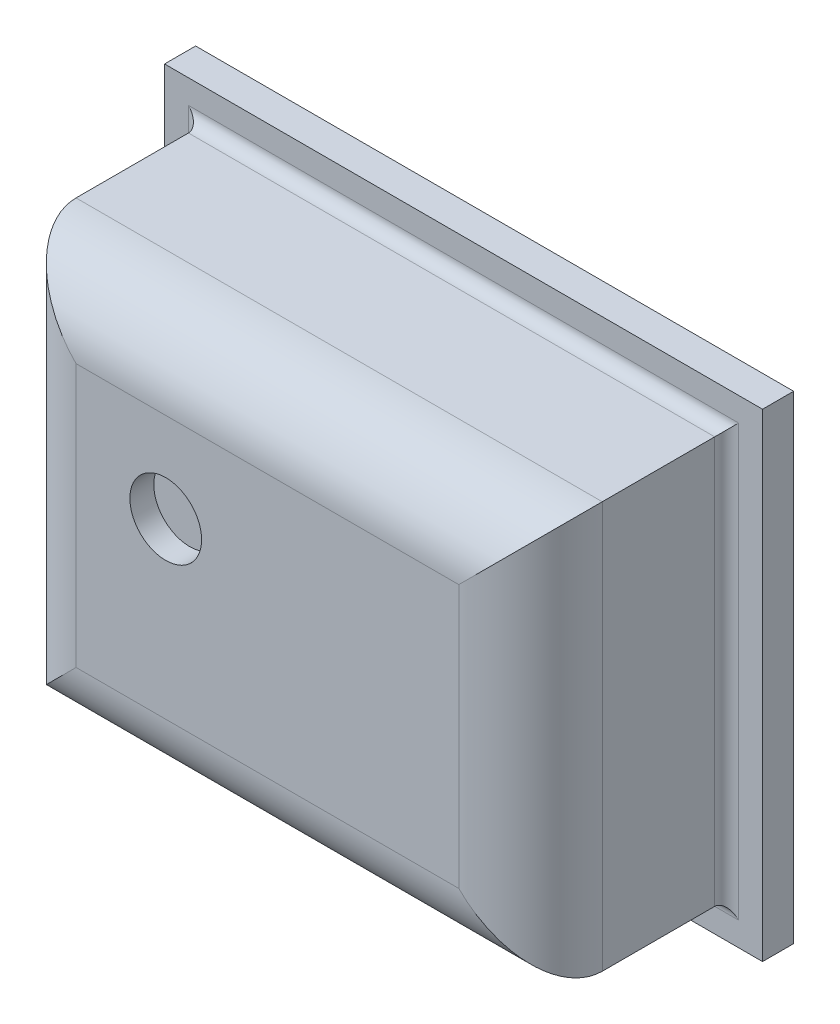
ISO-10303-21;
HEADER;
FILE_DESCRIPTION(('STEP AP214'),'2;1');
FILE_NAME('part.step','',(''),(''),'','','');
FILE_SCHEMA(('AUTOMOTIVE_DESIGN { 1 0 10303 214 1 1 1 1 }'));
ENDSEC;
DATA;
#1=APPLICATION_CONTEXT('core data for automotive mechanical design processes');
#2=APPLICATION_PROTOCOL_DEFINITION('international standard','automotive_design',2000,#1);
#3=PRODUCT_CONTEXT('',#1,'mechanical');
#4=PRODUCT('Part','Part','',(#3));
#5=PRODUCT_RELATED_PRODUCT_CATEGORY('part','',(#4));
#6=PRODUCT_DEFINITION_FORMATION('','',#4);
#7=PRODUCT_DEFINITION_CONTEXT('part definition',#1,'design');
#8=PRODUCT_DEFINITION('design','',#6,#7);
#9=PRODUCT_DEFINITION_SHAPE('','',#8);
#10=(LENGTH_UNIT() NAMED_UNIT(*) SI_UNIT(.MILLI.,.METRE.));
#11=(NAMED_UNIT(*) PLANE_ANGLE_UNIT() SI_UNIT($,.RADIAN.));
#12=(NAMED_UNIT(*) SI_UNIT($,.STERADIAN.) SOLID_ANGLE_UNIT());
#13=UNCERTAINTY_MEASURE_WITH_UNIT(LENGTH_MEASURE(1.E-05),#10,'distance_accuracy_value','');
#14=(GEOMETRIC_REPRESENTATION_CONTEXT(3) GLOBAL_UNCERTAINTY_ASSIGNED_CONTEXT((#13)) GLOBAL_UNIT_ASSIGNED_CONTEXT((#10,
#11,#12)) REPRESENTATION_CONTEXT('',''));
#15=CARTESIAN_POINT('',(0.,0.,0.));
#16=DIRECTION('',(0.,0.,1.));
#17=DIRECTION('',(1.,0.,0.));
#18=AXIS2_PLACEMENT_3D('',#15,#16,#17);
#19=CARTESIAN_POINT('',(1.25,1.,0.13));
#20=DIRECTION('',(-1.,0.,0.));
#21=DIRECTION('',(0.,-1.,0.));
#22=AXIS2_PLACEMENT_3D('',#19,#20,#21);
#23=PLANE('',#22);
#24=DIRECTION('',(0.,1.,0.));
#25=VECTOR('',#24,1.);
#26=CARTESIAN_POINT('',(1.25,1.,0.));
#27=LINE('',#26,#25);
#28=CARTESIAN_POINT('',(1.25,-1.,0.));
#29=VERTEX_POINT('',#28);
#30=CARTESIAN_POINT('',(1.25,1.,0.));
#31=VERTEX_POINT('',#30);
#32=EDGE_CURVE('E146',#29,#31,#27,.T.);
#33=ORIENTED_EDGE('',*,*,#32,.T.);
#34=DIRECTION('',(0.,0.,-1.));
#35=VECTOR('',#34,1.);
#36=CARTESIAN_POINT('',(1.25,1.,0.13));
#37=LINE('',#36,#35);
#38=CARTESIAN_POINT('',(1.25,1.,0.13));
#39=VERTEX_POINT('',#38);
#40=EDGE_CURVE('E127',#39,#31,#37,.T.);
#41=ORIENTED_EDGE('',*,*,#40,.F.);
#42=DIRECTION('',(0.,1.,0.));
#43=VECTOR('',#42,1.);
#44=CARTESIAN_POINT('',(1.25,1.,0.13));
#45=LINE('',#44,#43);
#46=CARTESIAN_POINT('',(1.25,-1.,0.13));
#47=VERTEX_POINT('',#46);
#48=EDGE_CURVE('E134',#47,#39,#45,.T.);
#49=ORIENTED_EDGE('',*,*,#48,.F.);
#50=DIRECTION('',(0.,0.,-1.));
#51=VECTOR('',#50,1.);
#52=CARTESIAN_POINT('',(1.25,-1.,0.13));
#53=LINE('',#52,#51);
#54=EDGE_CURVE('E228',#47,#29,#53,.T.);
#55=ORIENTED_EDGE('',*,*,#54,.T.);
#56=EDGE_LOOP('',(#33,#41,#49,#55));
#57=FACE_BOUND('',#56,.T.);
#58=ADVANCED_FACE('F32',(#57),#23,.F.);
#59=CARTESIAN_POINT('',(-1.25,1.,0.13));
#60=DIRECTION('',(0.,-1.,0.));
#61=DIRECTION('',(0.,0.,-1.));
#62=AXIS2_PLACEMENT_3D('',#59,#60,#61);
#63=PLANE('',#62);
#64=DIRECTION('',(-1.,0.,0.));
#65=VECTOR('',#64,1.);
#66=CARTESIAN_POINT('',(-1.25,1.,0.));
#67=LINE('',#66,#65);
#68=CARTESIAN_POINT('',(-1.25,1.,0.));
#69=VERTEX_POINT('',#68);
#70=EDGE_CURVE('E230',#31,#69,#67,.T.);
#71=ORIENTED_EDGE('',*,*,#70,.T.);
#72=DIRECTION('',(0.,0.,-1.));
#73=VECTOR('',#72,1.);
#74=CARTESIAN_POINT('',(-1.25,1.,0.13));
#75=LINE('',#74,#73);
#76=CARTESIAN_POINT('',(-1.25,1.,0.13));
#77=VERTEX_POINT('',#76);
#78=EDGE_CURVE('E130',#77,#69,#75,.T.);
#79=ORIENTED_EDGE('',*,*,#78,.F.);
#80=DIRECTION('',(-1.,0.,0.));
#81=VECTOR('',#80,1.);
#82=CARTESIAN_POINT('',(-1.25,1.,0.13));
#83=LINE('',#82,#81);
#84=EDGE_CURVE('E123',#39,#77,#83,.T.);
#85=ORIENTED_EDGE('',*,*,#84,.F.);
#86=ORIENTED_EDGE('',*,*,#40,.T.);
#87=EDGE_LOOP('',(#71,#79,#85,#86));
#88=FACE_BOUND('',#87,.T.);
#89=ADVANCED_FACE('F125',(#88),#63,.F.);
#90=CARTESIAN_POINT('',(-1.25,1.,0.13));
#91=DIRECTION('',(1.,0.,0.));
#92=DIRECTION('',(0.,1.,0.));
#93=AXIS2_PLACEMENT_3D('',#90,#91,#92);
#94=PLANE('',#93);
#95=DIRECTION('',(0.,-1.,0.));
#96=VECTOR('',#95,1.);
#97=CARTESIAN_POINT('',(-1.25,1.,0.));
#98=LINE('',#97,#96);
#99=CARTESIAN_POINT('',(-1.25,-1.,0.));
#100=VERTEX_POINT('',#99);
#101=EDGE_CURVE('E232',#69,#100,#98,.T.);
#102=ORIENTED_EDGE('',*,*,#101,.T.);
#103=DIRECTION('',(0.,0.,-1.));
#104=VECTOR('',#103,1.);
#105=CARTESIAN_POINT('',(-1.25,-1.,0.13));
#106=LINE('',#105,#104);
#107=CARTESIAN_POINT('',(-1.25,-1.,0.13));
#108=VERTEX_POINT('',#107);
#109=EDGE_CURVE('E151',#108,#100,#106,.T.);
#110=ORIENTED_EDGE('',*,*,#109,.F.);
#111=DIRECTION('',(0.,-1.,0.));
#112=VECTOR('',#111,1.);
#113=CARTESIAN_POINT('',(-1.25,1.,0.13));
#114=LINE('',#113,#112);
#115=EDGE_CURVE('E133',#77,#108,#114,.T.);
#116=ORIENTED_EDGE('',*,*,#115,.F.);
#117=ORIENTED_EDGE('',*,*,#78,.T.);
#118=EDGE_LOOP('',(#102,#110,#116,#117));
#119=FACE_BOUND('',#118,.T.);
#120=ADVANCED_FACE('F244',(#119),#94,.F.);
#121=CARTESIAN_POINT('',(-1.25,-1.,0.13));
#122=DIRECTION('',(0.,1.,0.));
#123=DIRECTION('',(0.,0.,1.));
#124=AXIS2_PLACEMENT_3D('',#121,#122,#123);
#125=PLANE('',#124);
#126=DIRECTION('',(1.,0.,0.));
#127=VECTOR('',#126,1.);
#128=CARTESIAN_POINT('',(-1.25,-1.,0.));
#129=LINE('',#128,#127);
#130=EDGE_CURVE('E143',#100,#29,#129,.T.);
#131=ORIENTED_EDGE('',*,*,#130,.T.);
#132=ORIENTED_EDGE('',*,*,#54,.F.);
#133=DIRECTION('',(1.,0.,0.));
#134=VECTOR('',#133,1.);
#135=CARTESIAN_POINT('',(-1.25,-1.,0.13));
#136=LINE('',#135,#134);
#137=EDGE_CURVE('E139',#108,#47,#136,.T.);
#138=ORIENTED_EDGE('',*,*,#137,.F.);
#139=ORIENTED_EDGE('',*,*,#109,.T.);
#140=EDGE_LOOP('',(#131,#132,#138,#139));
#141=FACE_BOUND('',#140,.T.);
#142=ADVANCED_FACE('F239',(#141),#125,.F.);
#143=CARTESIAN_POINT('',(0.,0.,0.13));
#144=DIRECTION('',(0.,0.,1.));
#145=DIRECTION('',(1.,0.,0.));
#146=AXIS2_PLACEMENT_3D('',#143,#144,#145);
#147=PLANE('',#146);
#148=DIRECTION('',(0.,-1.,0.));
#149=VECTOR('',#148,1.);
#150=CARTESIAN_POINT('',(-1.15,0.,0.13));
#151=LINE('',#150,#149);
#152=CARTESIAN_POINT('',(-1.15,-0.9,0.13));
#153=VERTEX_POINT('',#152);
#154=CARTESIAN_POINT('',(-1.15,0.9,0.13));
#155=VERTEX_POINT('',#154);
#156=EDGE_CURVE('E187',#153,#155,#151,.F.);
#157=ORIENTED_EDGE('',*,*,#156,.T.);
#158=DIRECTION('',(-1.,0.,0.));
#159=VECTOR('',#158,1.);
#160=CARTESIAN_POINT('',(0.,0.9,0.13));
#161=LINE('',#160,#159);
#162=CARTESIAN_POINT('',(1.15,0.9,0.13));
#163=VERTEX_POINT('',#162);
#164=EDGE_CURVE('E191',#155,#163,#161,.F.);
#165=ORIENTED_EDGE('',*,*,#164,.T.);
#166=DIRECTION('',(0.,1.,0.));
#167=VECTOR('',#166,1.);
#168=CARTESIAN_POINT('',(1.15,0.,0.13));
#169=LINE('',#168,#167);
#170=CARTESIAN_POINT('',(1.15,-0.9,0.13));
#171=VERTEX_POINT('',#170);
#172=EDGE_CURVE('E189',#163,#171,#169,.F.);
#173=ORIENTED_EDGE('',*,*,#172,.T.);
#174=DIRECTION('',(1.,0.,0.));
#175=VECTOR('',#174,1.);
#176=CARTESIAN_POINT('',(0.,-0.9,0.13));
#177=LINE('',#176,#175);
#178=EDGE_CURVE('E185',#171,#153,#177,.F.);
#179=ORIENTED_EDGE('',*,*,#178,.T.);
#180=EDGE_LOOP('',(#157,#165,#173,#179));
#181=FACE_BOUND('',#180,.T.);
#182=ORIENTED_EDGE('',*,*,#48,.T.);
#183=ORIENTED_EDGE('',*,*,#84,.T.);
#184=ORIENTED_EDGE('',*,*,#115,.T.);
#185=ORIENTED_EDGE('',*,*,#137,.T.);
#186=EDGE_LOOP('',(#182,#183,#184,#185));
#187=FACE_BOUND('',#186,.T.);
#188=ADVANCED_FACE('F137',(#181,#187),#147,.T.);
#189=CARTESIAN_POINT('',(0.,0.,0.));
#190=DIRECTION('',(0.,0.,1.));
#191=DIRECTION('',(1.,0.,0.));
#192=AXIS2_PLACEMENT_3D('',#189,#190,#191);
#193=PLANE('',#192);
#194=ORIENTED_EDGE('',*,*,#32,.F.);
#195=ORIENTED_EDGE('',*,*,#130,.F.);
#196=ORIENTED_EDGE('',*,*,#101,.F.);
#197=ORIENTED_EDGE('',*,*,#70,.F.);
#198=EDGE_LOOP('',(#194,#195,#196,#197));
#199=FACE_BOUND('',#198,.T.);
#200=ADVANCED_FACE('F243',(#199),#193,.F.);
#201=CARTESIAN_POINT('',(1.1,0.85,0.95));
#202=DIRECTION('',(-1.,0.,0.));
#203=DIRECTION('',(0.,-1.,0.));
#204=AXIS2_PLACEMENT_3D('',#201,#202,#203);
#205=PLANE('',#204);
#206=DIRECTION('',(0.,0.,-1.));
#207=VECTOR('',#206,1.);
#208=CARTESIAN_POINT('',(1.1,-0.85,0.95));
#209=LINE('',#208,#207);
#210=CARTESIAN_POINT('',(1.1,-0.85,0.65));
#211=VERTEX_POINT('',#210);
#212=CARTESIAN_POINT('',(1.1,-0.85,0.18));
#213=VERTEX_POINT('',#212);
#214=EDGE_CURVE('E182',#211,#213,#209,.T.);
#215=ORIENTED_EDGE('',*,*,#214,.T.);
#216=DIRECTION('',(0.,1.,0.));
#217=VECTOR('',#216,1.);
#218=CARTESIAN_POINT('',(1.1,0.85,0.18));
#219=LINE('',#218,#217);
#220=CARTESIAN_POINT('',(1.1,0.85,0.18));
#221=VERTEX_POINT('',#220);
#222=EDGE_CURVE('E194',#213,#221,#219,.T.);
#223=ORIENTED_EDGE('',*,*,#222,.T.);
#224=DIRECTION('',(0.,0.,-1.));
#225=VECTOR('',#224,1.);
#226=CARTESIAN_POINT('',(1.1,0.85,0.95));
#227=LINE('',#226,#225);
#228=CARTESIAN_POINT('',(1.1,0.85,0.65));
#229=VERTEX_POINT('',#228);
#230=EDGE_CURVE('E223',#229,#221,#227,.T.);
#231=ORIENTED_EDGE('',*,*,#230,.F.);
#232=DIRECTION('',(0.,1.,0.));
#233=VECTOR('',#232,1.);
#234=CARTESIAN_POINT('',(1.1,-0.85,0.65));
#235=LINE('',#234,#233);
#236=EDGE_CURVE('E168',#229,#211,#235,.F.);
#237=ORIENTED_EDGE('',*,*,#236,.T.);
#238=EDGE_LOOP('',(#215,#223,#231,#237));
#239=FACE_BOUND('',#238,.T.);
#240=ADVANCED_FACE('F302',(#239),#205,.F.);
#241=CARTESIAN_POINT('',(-1.1,0.85,0.95));
#242=DIRECTION('',(0.,-1.,0.));
#243=DIRECTION('',(0.,0.,-1.));
#244=AXIS2_PLACEMENT_3D('',#241,#242,#243);
#245=PLANE('',#244);
#246=ORIENTED_EDGE('',*,*,#230,.T.);
#247=DIRECTION('',(-1.,0.,0.));
#248=VECTOR('',#247,1.);
#249=CARTESIAN_POINT('',(-1.1,0.85,0.18));
#250=LINE('',#249,#248);
#251=CARTESIAN_POINT('',(-1.1,0.85,0.18));
#252=VERTEX_POINT('',#251);
#253=EDGE_CURVE('E170',#221,#252,#250,.T.);
#254=ORIENTED_EDGE('',*,*,#253,.T.);
#255=DIRECTION('',(0.,0.,-1.));
#256=VECTOR('',#255,1.);
#257=CARTESIAN_POINT('',(-1.1,0.85,0.95));
#258=LINE('',#257,#256);
#259=CARTESIAN_POINT('',(-1.1,0.85,0.65));
#260=VERTEX_POINT('',#259);
#261=EDGE_CURVE('E221',#260,#252,#258,.T.);
#262=ORIENTED_EDGE('',*,*,#261,.F.);
#263=DIRECTION('',(-1.,0.,0.));
#264=VECTOR('',#263,1.);
#265=CARTESIAN_POINT('',(1.1,0.85,0.65));
#266=LINE('',#265,#264);
#267=EDGE_CURVE('E166',#260,#229,#266,.F.);
#268=ORIENTED_EDGE('',*,*,#267,.T.);
#269=EDGE_LOOP('',(#246,#254,#262,#268));
#270=FACE_BOUND('',#269,.T.);
#271=ADVANCED_FACE('F305',(#270),#245,.F.);
#272=CARTESIAN_POINT('',(-1.1,0.85,0.95));
#273=DIRECTION('',(1.,0.,0.));
#274=DIRECTION('',(0.,0.,-1.));
#275=AXIS2_PLACEMENT_3D('',#272,#273,#274);
#276=PLANE('',#275);
#277=ORIENTED_EDGE('',*,*,#261,.T.);
#278=DIRECTION('',(0.,-1.,0.));
#279=VECTOR('',#278,1.);
#280=CARTESIAN_POINT('',(-1.1,0.85,0.18));
#281=LINE('',#280,#279);
#282=CARTESIAN_POINT('',(-1.1,-0.85,0.18));
#283=VERTEX_POINT('',#282);
#284=EDGE_CURVE('E41',#252,#283,#281,.T.);
#285=ORIENTED_EDGE('',*,*,#284,.T.);
#286=DIRECTION('',(0.,0.,-1.));
#287=VECTOR('',#286,1.);
#288=CARTESIAN_POINT('',(-1.1,-0.85,0.95));
#289=LINE('',#288,#287);
#290=CARTESIAN_POINT('',(-1.1,-0.85,0.65));
#291=VERTEX_POINT('',#290);
#292=EDGE_CURVE('E219',#291,#283,#289,.T.);
#293=ORIENTED_EDGE('',*,*,#292,.F.);
#294=DIRECTION('',(0.,-1.,0.));
#295=VECTOR('',#294,1.);
#296=CARTESIAN_POINT('',(-1.1,0.85,0.65));
#297=LINE('',#296,#295);
#298=EDGE_CURVE('E164',#291,#260,#297,.F.);
#299=ORIENTED_EDGE('',*,*,#298,.T.);
#300=EDGE_LOOP('',(#277,#285,#293,#299));
#301=FACE_BOUND('',#300,.T.);
#302=ADVANCED_FACE('F320',(#301),#276,.F.);
#303=CARTESIAN_POINT('',(-1.1,-0.85,0.95));
#304=DIRECTION('',(0.,1.,0.));
#305=DIRECTION('',(0.,0.,1.));
#306=AXIS2_PLACEMENT_3D('',#303,#304,#305);
#307=PLANE('',#306);
#308=ORIENTED_EDGE('',*,*,#292,.T.);
#309=DIRECTION('',(1.,0.,0.));
#310=VECTOR('',#309,1.);
#311=CARTESIAN_POINT('',(-1.1,-0.85,0.18));
#312=LINE('',#311,#310);
#313=EDGE_CURVE('E11',#283,#213,#312,.T.);
#314=ORIENTED_EDGE('',*,*,#313,.T.);
#315=ORIENTED_EDGE('',*,*,#214,.F.);
#316=DIRECTION('',(1.,0.,0.));
#317=VECTOR('',#316,1.);
#318=CARTESIAN_POINT('',(-1.1,-0.85,0.65));
#319=LINE('',#318,#317);
#320=EDGE_CURVE('E161',#211,#291,#319,.F.);
#321=ORIENTED_EDGE('',*,*,#320,.T.);
#322=EDGE_LOOP('',(#308,#314,#315,#321));
#323=FACE_BOUND('',#322,.T.);
#324=ADVANCED_FACE('F319',(#323),#307,.F.);
#325=CARTESIAN_POINT('',(0.,0.,0.95));
#326=DIRECTION('',(0.,0.,1.));
#327=DIRECTION('',(1.,0.,0.));
#328=AXIS2_PLACEMENT_3D('',#325,#326,#327);
#329=PLANE('',#328);
#330=CARTESIAN_POINT('',(-0.425,0.175,0.95));
#331=DIRECTION('',(0.,0.,1.));
#332=DIRECTION('',(1.,0.,0.));
#333=AXIS2_PLACEMENT_3D('',#330,#331,#332);
#334=CIRCLE('',#333,0.15);
#335=CARTESIAN_POINT('',(-0.275000000000001,0.175,0.95));
#336=VERTEX_POINT('',#335);
#337=EDGE_CURVE('E206',#336,#336,#334,.T.);
#338=ORIENTED_EDGE('',*,*,#337,.F.);
#339=EDGE_LOOP('',(#338));
#340=FACE_BOUND('',#339,.T.);
#341=DIRECTION('',(0.,-1.,0.));
#342=VECTOR('',#341,1.);
#343=CARTESIAN_POINT('',(-0.8,-0.85,0.95));
#344=LINE('',#343,#342);
#345=CARTESIAN_POINT('',(-0.8,0.55,0.95));
#346=VERTEX_POINT('',#345);
#347=CARTESIAN_POINT('',(-0.8,-0.55,0.95));
#348=VERTEX_POINT('',#347);
#349=EDGE_CURVE('E156',#346,#348,#344,.T.);
#350=ORIENTED_EDGE('',*,*,#349,.T.);
#351=DIRECTION('',(1.,0.,0.));
#352=VECTOR('',#351,1.);
#353=CARTESIAN_POINT('',(1.1,-0.55,0.95));
#354=LINE('',#353,#352);
#355=CARTESIAN_POINT('',(0.8,-0.55,0.95));
#356=VERTEX_POINT('',#355);
#357=EDGE_CURVE('E158',#348,#356,#354,.T.);
#358=ORIENTED_EDGE('',*,*,#357,.T.);
#359=DIRECTION('',(0.,1.,0.));
#360=VECTOR('',#359,1.);
#361=CARTESIAN_POINT('',(0.8,0.85,0.95));
#362=LINE('',#361,#360);
#363=CARTESIAN_POINT('',(0.8,0.55,0.95));
#364=VERTEX_POINT('',#363);
#365=EDGE_CURVE('E147',#356,#364,#362,.T.);
#366=ORIENTED_EDGE('',*,*,#365,.T.);
#367=DIRECTION('',(-1.,0.,0.));
#368=VECTOR('',#367,1.);
#369=CARTESIAN_POINT('',(-1.1,0.55,0.95));
#370=LINE('',#369,#368);
#371=EDGE_CURVE('E149',#364,#346,#370,.T.);
#372=ORIENTED_EDGE('',*,*,#371,.T.);
#373=EDGE_LOOP('',(#350,#358,#366,#372));
#374=FACE_BOUND('',#373,.T.);
#375=ADVANCED_FACE('F274',(#340,#374),#329,.T.);
#376=CARTESIAN_POINT('',(0.,0.55,0.65));
#377=DIRECTION('',(1.,0.,0.));
#378=DIRECTION('',(0.,0.,-1.));
#379=AXIS2_PLACEMENT_3D('',#376,#377,#378);
#380=CYLINDRICAL_SURFACE('',#379,0.3);
#381=CARTESIAN_POINT('',(0.8,0.55,0.65));
#382=DIRECTION('',(0.707106781186548,-0.707106781186547,0.));
#383=DIRECTION('',(-0.707106781186547,-0.707106781186548,0.));
#384=AXIS2_PLACEMENT_3D('',#381,#382,#383);
#385=ELLIPSE('',#384,0.424264068711928,0.3);
#386=EDGE_CURVE('E176',#229,#364,#385,.T.);
#387=ORIENTED_EDGE('',*,*,#386,.F.);
#388=ORIENTED_EDGE('',*,*,#267,.F.);
#389=CARTESIAN_POINT('',(-0.8,0.55,0.65));
#390=DIRECTION('',(0.707106781186547,0.707106781186547,0.));
#391=DIRECTION('',(0.707106781186547,-0.707106781186547,0.));
#392=AXIS2_PLACEMENT_3D('',#389,#390,#391);
#393=ELLIPSE('',#392,0.424264068711928,0.3);
#394=EDGE_CURVE('E179',#346,#260,#393,.F.);
#395=ORIENTED_EDGE('',*,*,#394,.F.);
#396=ORIENTED_EDGE('',*,*,#371,.F.);
#397=EDGE_LOOP('',(#387,#388,#395,#396));
#398=FACE_BOUND('',#397,.T.);
#399=ADVANCED_FACE('F270',(#398),#380,.T.);
#400=CARTESIAN_POINT('',(-0.8,0.,0.65));
#401=DIRECTION('',(0.,1.,0.));
#402=DIRECTION('',(0.,0.,1.));
#403=AXIS2_PLACEMENT_3D('',#400,#401,#402);
#404=CYLINDRICAL_SURFACE('',#403,0.3);
#405=ORIENTED_EDGE('',*,*,#394,.T.);
#406=ORIENTED_EDGE('',*,*,#298,.F.);
#407=CARTESIAN_POINT('',(-0.8,-0.55,0.65));
#408=DIRECTION('',(-0.707106781186547,0.707106781186547,0.));
#409=DIRECTION('',(0.707106781186547,0.707106781186547,0.));
#410=AXIS2_PLACEMENT_3D('',#407,#408,#409);
#411=ELLIPSE('',#410,0.424264068711928,0.3);
#412=EDGE_CURVE('E173',#348,#291,#411,.F.);
#413=ORIENTED_EDGE('',*,*,#412,.F.);
#414=ORIENTED_EDGE('',*,*,#349,.F.);
#415=EDGE_LOOP('',(#405,#406,#413,#414));
#416=FACE_BOUND('',#415,.T.);
#417=ADVANCED_FACE('F266',(#416),#404,.T.);
#418=CARTESIAN_POINT('',(0.8,0.,0.65));
#419=DIRECTION('',(0.,-1.,0.));
#420=DIRECTION('',(1.,0.,0.));
#421=AXIS2_PLACEMENT_3D('',#418,#419,#420);
#422=CYLINDRICAL_SURFACE('',#421,0.3);
#423=ORIENTED_EDGE('',*,*,#386,.T.);
#424=ORIENTED_EDGE('',*,*,#365,.F.);
#425=CARTESIAN_POINT('',(0.8,-0.55,0.65));
#426=DIRECTION('',(-0.707106781186547,-0.707106781186548,0.));
#427=DIRECTION('',(0.707106781186548,-0.707106781186547,0.));
#428=AXIS2_PLACEMENT_3D('',#425,#426,#427);
#429=ELLIPSE('',#428,0.424264068711929,0.3);
#430=EDGE_CURVE('E171',#211,#356,#429,.T.);
#431=ORIENTED_EDGE('',*,*,#430,.F.);
#432=ORIENTED_EDGE('',*,*,#236,.F.);
#433=EDGE_LOOP('',(#423,#424,#431,#432));
#434=FACE_BOUND('',#433,.T.);
#435=ADVANCED_FACE('F262',(#434),#422,.T.);
#436=CARTESIAN_POINT('',(0.,-0.55,0.65));
#437=DIRECTION('',(-1.,0.,0.));
#438=DIRECTION('',(0.,0.,1.));
#439=AXIS2_PLACEMENT_3D('',#436,#437,#438);
#440=CYLINDRICAL_SURFACE('',#439,0.3);
#441=ORIENTED_EDGE('',*,*,#412,.T.);
#442=ORIENTED_EDGE('',*,*,#320,.F.);
#443=ORIENTED_EDGE('',*,*,#430,.T.);
#444=ORIENTED_EDGE('',*,*,#357,.F.);
#445=EDGE_LOOP('',(#441,#442,#443,#444));
#446=FACE_BOUND('',#445,.T.);
#447=ADVANCED_FACE('F258',(#446),#440,.T.);
#448=CARTESIAN_POINT('',(-0.425,0.175,0.85));
#449=DIRECTION('',(0.,0.,1.));
#450=DIRECTION('',(1.,0.,0.));
#451=AXIS2_PLACEMENT_3D('',#448,#449,#450);
#452=CYLINDRICAL_SURFACE('',#451,0.15);
#453=CARTESIAN_POINT('',(-0.425,0.175,0.85));
#454=DIRECTION('',(0.,0.,1.));
#455=DIRECTION('',(1.,0.,0.));
#456=AXIS2_PLACEMENT_3D('',#453,#454,#455);
#457=CIRCLE('',#456,0.15);
#458=CARTESIAN_POINT('',(-0.275000000000001,0.175,0.85));
#459=VERTEX_POINT('',#458);
#460=EDGE_CURVE('E174',#459,#459,#457,.T.);
#461=ORIENTED_EDGE('',*,*,#460,.F.);
#462=EDGE_LOOP('',(#461));
#463=FACE_BOUND('',#462,.T.);
#464=ORIENTED_EDGE('',*,*,#337,.T.);
#465=EDGE_LOOP('',(#464));
#466=FACE_BOUND('',#465,.T.);
#467=ADVANCED_FACE('F261',(#463,#466),#452,.F.);
#468=CARTESIAN_POINT('',(-0.425,0.175,0.85));
#469=DIRECTION('',(0.,0.,1.));
#470=DIRECTION('',(1.,0.,0.));
#471=AXIS2_PLACEMENT_3D('',#468,#469,#470);
#472=PLANE('',#471);
#473=ORIENTED_EDGE('',*,*,#460,.T.);
#474=EDGE_LOOP('',(#473));
#475=FACE_BOUND('',#474,.T.);
#476=ADVANCED_FACE('F287',(#475),#472,.T.);
#477=CARTESIAN_POINT('',(-1.1,-0.9,0.18));
#478=DIRECTION('',(1.,0.,0.));
#479=DIRECTION('',(0.,0.,-1.));
#480=AXIS2_PLACEMENT_3D('',#477,#478,#479);
#481=CYLINDRICAL_SURFACE('',#480,0.05);
#482=CARTESIAN_POINT('',(-1.15,-0.9,0.18));
#483=DIRECTION('',(0.707106781186547,-0.707106781186547,0.));
#484=DIRECTION('',(0.707106781186547,0.707106781186547,0.));
#485=AXIS2_PLACEMENT_3D('',#482,#483,#484);
#486=ELLIPSE('',#485,0.0707106781186548,0.05);
#487=EDGE_CURVE('E200',#153,#283,#486,.T.);
#488=ORIENTED_EDGE('',*,*,#487,.F.);
#489=ORIENTED_EDGE('',*,*,#178,.F.);
#490=CARTESIAN_POINT('',(1.15,-0.9,0.18));
#491=DIRECTION('',(0.707106781186547,0.707106781186548,0.));
#492=DIRECTION('',(0.707106781186548,-0.707106781186547,0.));
#493=AXIS2_PLACEMENT_3D('',#490,#491,#492);
#494=ELLIPSE('',#493,0.0707106781186548,0.05);
#495=EDGE_CURVE('E36',#213,#171,#494,.F.);
#496=ORIENTED_EDGE('',*,*,#495,.F.);
#497=ORIENTED_EDGE('',*,*,#313,.F.);
#498=EDGE_LOOP('',(#488,#489,#496,#497));
#499=FACE_BOUND('',#498,.T.);
#500=ADVANCED_FACE('F34',(#499),#481,.F.);
#501=CARTESIAN_POINT('',(1.15,0.85,0.18));
#502=DIRECTION('',(0.,1.,0.));
#503=DIRECTION('',(-1.,0.,0.));
#504=AXIS2_PLACEMENT_3D('',#501,#502,#503);
#505=CYLINDRICAL_SURFACE('',#504,0.05);
#506=ORIENTED_EDGE('',*,*,#495,.T.);
#507=ORIENTED_EDGE('',*,*,#172,.F.);
#508=CARTESIAN_POINT('',(1.15,0.9,0.18));
#509=DIRECTION('',(-0.707106781186548,0.707106781186547,0.));
#510=DIRECTION('',(0.707106781186547,0.707106781186548,0.));
#511=AXIS2_PLACEMENT_3D('',#508,#509,#510);
#512=ELLIPSE('',#511,0.0707106781186548,0.05);
#513=EDGE_CURVE('E199',#221,#163,#512,.F.);
#514=ORIENTED_EDGE('',*,*,#513,.F.);
#515=ORIENTED_EDGE('',*,*,#222,.F.);
#516=EDGE_LOOP('',(#506,#507,#514,#515));
#517=FACE_BOUND('',#516,.T.);
#518=ADVANCED_FACE('F282',(#517),#505,.F.);
#519=CARTESIAN_POINT('',(-1.15,0.85,0.18));
#520=DIRECTION('',(0.,-1.,0.));
#521=DIRECTION('',(0.,0.,-1.));
#522=AXIS2_PLACEMENT_3D('',#519,#520,#521);
#523=CYLINDRICAL_SURFACE('',#522,0.05);
#524=ORIENTED_EDGE('',*,*,#487,.T.);
#525=ORIENTED_EDGE('',*,*,#284,.F.);
#526=CARTESIAN_POINT('',(-1.15,0.9,0.18));
#527=DIRECTION('',(-0.707106781186547,-0.707106781186547,0.));
#528=DIRECTION('',(0.707106781186547,-0.707106781186547,0.));
#529=AXIS2_PLACEMENT_3D('',#526,#527,#528);
#530=ELLIPSE('',#529,0.0707106781186548,0.05);
#531=EDGE_CURVE('E197',#155,#252,#530,.T.);
#532=ORIENTED_EDGE('',*,*,#531,.F.);
#533=ORIENTED_EDGE('',*,*,#156,.F.);
#534=EDGE_LOOP('',(#524,#525,#532,#533));
#535=FACE_BOUND('',#534,.T.);
#536=ADVANCED_FACE('F279',(#535),#523,.F.);
#537=CARTESIAN_POINT('',(-1.1,0.9,0.18));
#538=DIRECTION('',(-1.,0.,0.));
#539=DIRECTION('',(0.,0.,1.));
#540=AXIS2_PLACEMENT_3D('',#537,#538,#539);
#541=CYLINDRICAL_SURFACE('',#540,0.05);
#542=ORIENTED_EDGE('',*,*,#513,.T.);
#543=ORIENTED_EDGE('',*,*,#164,.F.);
#544=ORIENTED_EDGE('',*,*,#531,.T.);
#545=ORIENTED_EDGE('',*,*,#253,.F.);
#546=EDGE_LOOP('',(#542,#543,#544,#545));
#547=FACE_BOUND('',#546,.T.);
#548=ADVANCED_FACE('F276',(#547),#541,.F.);
#549=CLOSED_SHELL('',(#58,#89,#120,#142,#188,#200,#240,#271,#302,#324,#375,#399,#417,#435,#447,
#467,#476,#500,#518,#536,#548));
#550=MANIFOLD_SOLID_BREP('B2',#549);
#551=ADVANCED_BREP_SHAPE_REPRESENTATION('',(#18,#550),#14);
#552=SHAPE_DEFINITION_REPRESENTATION(#9,#551);
ENDSEC;
END-ISO-10303-21;
